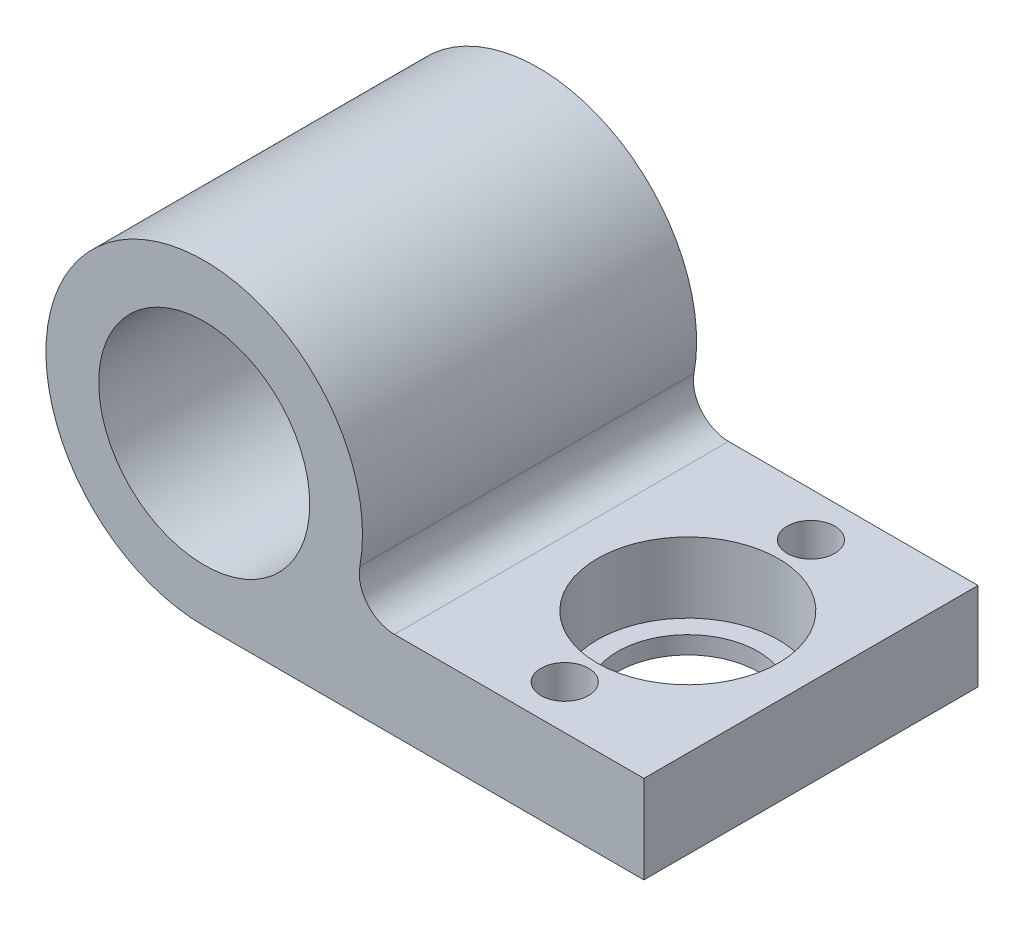
ISO-10303-21;
HEADER;
FILE_DESCRIPTION(('STEP AP214'),'2;1');
FILE_NAME('part.step','',(''),(''),'','','');
FILE_SCHEMA(('AUTOMOTIVE_DESIGN { 1 0 10303 214 1 1 1 1 }'));
ENDSEC;
DATA;
#1=APPLICATION_CONTEXT('core data for automotive mechanical design processes');
#2=APPLICATION_PROTOCOL_DEFINITION('international standard','automotive_design',2000,#1);
#3=PRODUCT_CONTEXT('',#1,'mechanical');
#4=PRODUCT('Part','Part','',(#3));
#5=PRODUCT_RELATED_PRODUCT_CATEGORY('part','',(#4));
#6=PRODUCT_DEFINITION_FORMATION('','',#4);
#7=PRODUCT_DEFINITION_CONTEXT('part definition',#1,'design');
#8=PRODUCT_DEFINITION('design','',#6,#7);
#9=PRODUCT_DEFINITION_SHAPE('','',#8);
#10=(LENGTH_UNIT() NAMED_UNIT(*) SI_UNIT(.MILLI.,.METRE.));
#11=(NAMED_UNIT(*) PLANE_ANGLE_UNIT() SI_UNIT($,.RADIAN.));
#12=(NAMED_UNIT(*) SI_UNIT($,.STERADIAN.) SOLID_ANGLE_UNIT());
#13=UNCERTAINTY_MEASURE_WITH_UNIT(LENGTH_MEASURE(1.E-05),#10,'distance_accuracy_value','');
#14=(GEOMETRIC_REPRESENTATION_CONTEXT(3) GLOBAL_UNCERTAINTY_ASSIGNED_CONTEXT((#13)) GLOBAL_UNIT_ASSIGNED_CONTEXT((#10,
#11,#12)) REPRESENTATION_CONTEXT('',''));
#15=CARTESIAN_POINT('',(0.,0.,0.));
#16=DIRECTION('',(0.,0.,1.));
#17=DIRECTION('',(1.,0.,0.));
#18=AXIS2_PLACEMENT_3D('',#15,#16,#17);
#19=CARTESIAN_POINT('',(18.,-4.,0.));
#20=DIRECTION('',(0.,-1.,0.));
#21=DIRECTION('',(0.,0.,-1.));
#22=AXIS2_PLACEMENT_3D('',#19,#20,#21);
#23=CYLINDRICAL_SURFACE('',#22,4.);
#24=CARTESIAN_POINT('',(18.,-9.,0.));
#25=DIRECTION('',(0.,1.,0.));
#26=DIRECTION('',(0.,0.,1.));
#27=AXIS2_PLACEMENT_3D('',#24,#25,#26);
#28=CIRCLE('',#27,4.);
#29=CARTESIAN_POINT('',(18.,-9.,4.));
#30=VERTEX_POINT('',#29);
#31=EDGE_CURVE('E150',#30,#30,#28,.T.);
#32=ORIENTED_EDGE('',*,*,#31,.F.);
#33=EDGE_LOOP('',(#32));
#34=FACE_BOUND('',#33,.T.);
#35=CARTESIAN_POINT('',(18.,-8.,0.));
#36=DIRECTION('',(0.,1.,0.));
#37=DIRECTION('',(0.,0.,1.));
#38=AXIS2_PLACEMENT_3D('',#35,#36,#37);
#39=CIRCLE('',#38,4.);
#40=CARTESIAN_POINT('',(18.,-8.,4.));
#41=VERTEX_POINT('',#40);
#42=EDGE_CURVE('E123',#41,#41,#39,.T.);
#43=ORIENTED_EDGE('',*,*,#42,.T.);
#44=EDGE_LOOP('',(#43));
#45=FACE_BOUND('',#44,.T.);
#46=ADVANCED_FACE('F33',(#34,#45),#23,.F.);
#47=CARTESIAN_POINT('',(0.,0.,9.5));
#48=DIRECTION('',(0.,0.,1.));
#49=DIRECTION('',(1.,0.,0.));
#50=AXIS2_PLACEMENT_3D('',#47,#48,#49);
#51=PLANE('',#50);
#52=CARTESIAN_POINT('',(0.,0.,9.5));
#53=DIRECTION('',(0.,0.,1.));
#54=DIRECTION('',(1.,0.,0.));
#55=AXIS2_PLACEMENT_3D('',#52,#53,#54);
#56=CIRCLE('',#55,6.);
#57=CARTESIAN_POINT('',(6.,0.,9.5));
#58=VERTEX_POINT('',#57);
#59=EDGE_CURVE('E113',#58,#58,#56,.T.);
#60=ORIENTED_EDGE('',*,*,#59,.F.);
#61=EDGE_LOOP('',(#60));
#62=FACE_BOUND('',#61,.T.);
#63=DIRECTION('',(1.,0.,0.));
#64=VECTOR('',#63,1.);
#65=CARTESIAN_POINT('',(0.,-4.,9.5));
#66=LINE('',#65,#64);
#67=CARTESIAN_POINT('',(10.816653826392,-4.,9.5));
#68=VERTEX_POINT('',#67);
#69=CARTESIAN_POINT('',(25.,-4.,9.5));
#70=VERTEX_POINT('',#69);
#71=EDGE_CURVE('E76',#68,#70,#66,.T.);
#72=ORIENTED_EDGE('',*,*,#71,.F.);
#73=CARTESIAN_POINT('',(10.816653826392,-2.,9.5));
#74=DIRECTION('',(0.,0.,1.));
#75=DIRECTION('',(1.,0.,0.));
#76=AXIS2_PLACEMENT_3D('',#73,#74,#75);
#77=CIRCLE('',#76,2.);
#78=CARTESIAN_POINT('',(8.8499894943207,-1.63636363636364,9.5));
#79=VERTEX_POINT('',#78);
#80=EDGE_CURVE('E11',#68,#79,#77,.F.);
#81=ORIENTED_EDGE('',*,*,#80,.T.);
#82=CARTESIAN_POINT('',(0.,0.,9.5));
#83=DIRECTION('',(0.,0.,1.));
#84=DIRECTION('',(1.,0.,0.));
#85=AXIS2_PLACEMENT_3D('',#82,#83,#84);
#86=CIRCLE('',#85,9.);
#87=CARTESIAN_POINT('',(0.,-9.,9.5));
#88=VERTEX_POINT('',#87);
#89=EDGE_CURVE('E119',#79,#88,#86,.T.);
#90=ORIENTED_EDGE('',*,*,#89,.T.);
#91=DIRECTION('',(1.,0.,0.));
#92=VECTOR('',#91,1.);
#93=CARTESIAN_POINT('',(0.,-9.,9.5));
#94=LINE('',#93,#92);
#95=CARTESIAN_POINT('',(25.,-9.,9.5));
#96=VERTEX_POINT('',#95);
#97=EDGE_CURVE('E90',#88,#96,#94,.T.);
#98=ORIENTED_EDGE('',*,*,#97,.T.);
#99=DIRECTION('',(0.,-1.,0.));
#100=VECTOR('',#99,1.);
#101=CARTESIAN_POINT('',(25.,-4.,9.5));
#102=LINE('',#101,#100);
#103=EDGE_CURVE('E87',#70,#96,#102,.T.);
#104=ORIENTED_EDGE('',*,*,#103,.F.);
#105=EDGE_LOOP('',(#72,#81,#90,#98,#104));
#106=FACE_BOUND('',#105,.T.);
#107=ADVANCED_FACE('F88',(#62,#106),#51,.T.);
#108=CARTESIAN_POINT('',(0.,0.,-9.5));
#109=DIRECTION('',(0.,0.,1.));
#110=DIRECTION('',(1.,0.,0.));
#111=AXIS2_PLACEMENT_3D('',#108,#109,#110);
#112=PLANE('',#111);
#113=CARTESIAN_POINT('',(0.,0.,-9.5));
#114=DIRECTION('',(0.,0.,1.));
#115=DIRECTION('',(1.,0.,0.));
#116=AXIS2_PLACEMENT_3D('',#113,#114,#115);
#117=CIRCLE('',#116,6.);
#118=CARTESIAN_POINT('',(6.,0.,-9.5));
#119=VERTEX_POINT('',#118);
#120=EDGE_CURVE('E93',#119,#119,#117,.T.);
#121=ORIENTED_EDGE('',*,*,#120,.T.);
#122=EDGE_LOOP('',(#121));
#123=FACE_BOUND('',#122,.T.);
#124=CARTESIAN_POINT('',(0.,0.,-9.5));
#125=DIRECTION('',(0.,0.,1.));
#126=DIRECTION('',(1.,0.,0.));
#127=AXIS2_PLACEMENT_3D('',#124,#125,#126);
#128=CIRCLE('',#127,9.);
#129=CARTESIAN_POINT('',(8.8499894943207,-1.63636363636364,-9.5));
#130=VERTEX_POINT('',#129);
#131=CARTESIAN_POINT('',(0.,-9.,-9.5));
#132=VERTEX_POINT('',#131);
#133=EDGE_CURVE('E116',#130,#132,#128,.T.);
#134=ORIENTED_EDGE('',*,*,#133,.F.);
#135=CARTESIAN_POINT('',(10.816653826392,-2.,-9.5));
#136=DIRECTION('',(0.,0.,1.));
#137=DIRECTION('',(1.,0.,0.));
#138=AXIS2_PLACEMENT_3D('',#135,#136,#137);
#139=CIRCLE('',#138,2.);
#140=CARTESIAN_POINT('',(10.816653826392,-4.,-9.5));
#141=VERTEX_POINT('',#140);
#142=EDGE_CURVE('E41',#130,#141,#139,.T.);
#143=ORIENTED_EDGE('',*,*,#142,.T.);
#144=DIRECTION('',(-1.,0.,0.));
#145=VECTOR('',#144,1.);
#146=CARTESIAN_POINT('',(0.,-4.,-9.5));
#147=LINE('',#146,#145);
#148=CARTESIAN_POINT('',(25.,-4.,-9.5));
#149=VERTEX_POINT('',#148);
#150=EDGE_CURVE('E98',#149,#141,#147,.T.);
#151=ORIENTED_EDGE('',*,*,#150,.F.);
#152=DIRECTION('',(0.,-1.,0.));
#153=VECTOR('',#152,1.);
#154=CARTESIAN_POINT('',(25.,-4.,-9.5));
#155=LINE('',#154,#153);
#156=CARTESIAN_POINT('',(25.,-9.,-9.5));
#157=VERTEX_POINT('',#156);
#158=EDGE_CURVE('E94',#149,#157,#155,.T.);
#159=ORIENTED_EDGE('',*,*,#158,.T.);
#160=DIRECTION('',(-1.,0.,0.));
#161=VECTOR('',#160,1.);
#162=CARTESIAN_POINT('',(0.,-9.,-9.5));
#163=LINE('',#162,#161);
#164=EDGE_CURVE('E84',#157,#132,#163,.T.);
#165=ORIENTED_EDGE('',*,*,#164,.T.);
#166=EDGE_LOOP('',(#134,#143,#151,#159,#165));
#167=FACE_BOUND('',#166,.T.);
#168=ADVANCED_FACE('F135',(#123,#167),#112,.F.);
#169=CARTESIAN_POINT('',(0.,0.,9.5));
#170=DIRECTION('',(0.,0.,-1.));
#171=DIRECTION('',(-1.,0.,0.));
#172=AXIS2_PLACEMENT_3D('',#169,#170,#171);
#173=CYLINDRICAL_SURFACE('',#172,9.);
#174=ORIENTED_EDGE('',*,*,#89,.F.);
#175=DIRECTION('',(0.,0.,-1.));
#176=VECTOR('',#175,1.);
#177=CARTESIAN_POINT('',(8.8499894943207,-1.63636363636364,9.5));
#178=LINE('',#177,#176);
#179=EDGE_CURVE('E121',#79,#130,#178,.T.);
#180=ORIENTED_EDGE('',*,*,#179,.T.);
#181=ORIENTED_EDGE('',*,*,#133,.T.);
#182=DIRECTION('',(0.,0.,1.));
#183=VECTOR('',#182,1.);
#184=CARTESIAN_POINT('',(0.,-9.,-9.5));
#185=LINE('',#184,#183);
#186=EDGE_CURVE('E103',#132,#88,#185,.T.);
#187=ORIENTED_EDGE('',*,*,#186,.T.);
#188=EDGE_LOOP('',(#174,#180,#181,#187));
#189=FACE_BOUND('',#188,.T.);
#190=ADVANCED_FACE('F133',(#189),#173,.T.);
#191=CARTESIAN_POINT('',(0.,0.,9.5));
#192=DIRECTION('',(0.,0.,-1.));
#193=DIRECTION('',(-1.,0.,0.));
#194=AXIS2_PLACEMENT_3D('',#191,#192,#193);
#195=CYLINDRICAL_SURFACE('',#194,6.);
#196=ORIENTED_EDGE('',*,*,#120,.F.);
#197=EDGE_LOOP('',(#196));
#198=FACE_BOUND('',#197,.T.);
#199=ORIENTED_EDGE('',*,*,#59,.T.);
#200=EDGE_LOOP('',(#199));
#201=FACE_BOUND('',#200,.T.);
#202=ADVANCED_FACE('F169',(#198,#201),#195,.F.);
#203=CARTESIAN_POINT('',(0.,-4.,0.));
#204=DIRECTION('',(0.,1.,0.));
#205=DIRECTION('',(0.,0.,1.));
#206=AXIS2_PLACEMENT_3D('',#203,#204,#205);
#207=PLANE('',#206);
#208=CARTESIAN_POINT('',(18.,-4.,0.));
#209=DIRECTION('',(0.,1.,0.));
#210=DIRECTION('',(0.,0.,1.));
#211=AXIS2_PLACEMENT_3D('',#208,#209,#210);
#212=CIRCLE('',#211,5.15);
#213=CARTESIAN_POINT('',(18.,-4.,5.15));
#214=VERTEX_POINT('',#213);
#215=EDGE_CURVE('E295',#214,#214,#212,.T.);
#216=ORIENTED_EDGE('',*,*,#215,.F.);
#217=EDGE_LOOP('',(#216));
#218=FACE_BOUND('',#217,.T.);
#219=CARTESIAN_POINT('',(18.,-4.,7.));
#220=DIRECTION('',(0.,1.,0.));
#221=DIRECTION('',(0.,0.,1.));
#222=AXIS2_PLACEMENT_3D('',#219,#220,#221);
#223=CIRCLE('',#222,1.35);
#224=CARTESIAN_POINT('',(18.,-4.,8.35));
#225=VERTEX_POINT('',#224);
#226=EDGE_CURVE('E106',#225,#225,#223,.T.);
#227=ORIENTED_EDGE('',*,*,#226,.F.);
#228=EDGE_LOOP('',(#227));
#229=FACE_BOUND('',#228,.T.);
#230=CARTESIAN_POINT('',(18.,-4.,-7.));
#231=DIRECTION('',(0.,1.,0.));
#232=DIRECTION('',(0.,0.,1.));
#233=AXIS2_PLACEMENT_3D('',#230,#231,#232);
#234=CIRCLE('',#233,1.35);
#235=CARTESIAN_POINT('',(18.,-4.,-5.65));
#236=VERTEX_POINT('',#235);
#237=EDGE_CURVE('E154',#236,#236,#234,.T.);
#238=ORIENTED_EDGE('',*,*,#237,.F.);
#239=EDGE_LOOP('',(#238));
#240=FACE_BOUND('',#239,.T.);
#241=ORIENTED_EDGE('',*,*,#150,.T.);
#242=DIRECTION('',(0.,0.,-1.));
#243=VECTOR('',#242,1.);
#244=CARTESIAN_POINT('',(10.816653826392,-4.,0.));
#245=LINE('',#244,#243);
#246=EDGE_CURVE('E54',#141,#68,#245,.F.);
#247=ORIENTED_EDGE('',*,*,#246,.T.);
#248=ORIENTED_EDGE('',*,*,#71,.T.);
#249=DIRECTION('',(0.,0.,-1.));
#250=VECTOR('',#249,1.);
#251=CARTESIAN_POINT('',(25.,-4.,-9.5));
#252=LINE('',#251,#250);
#253=EDGE_CURVE('E80',#70,#149,#252,.T.);
#254=ORIENTED_EDGE('',*,*,#253,.T.);
#255=EDGE_LOOP('',(#241,#247,#248,#254));
#256=FACE_BOUND('',#255,.T.);
#257=ADVANCED_FACE('F78',(#218,#229,#240,#256),#207,.T.);
#258=CARTESIAN_POINT('',(0.,-9.,0.));
#259=DIRECTION('',(0.,1.,0.));
#260=DIRECTION('',(0.,0.,1.));
#261=AXIS2_PLACEMENT_3D('',#258,#259,#260);
#262=PLANE('',#261);
#263=ORIENTED_EDGE('',*,*,#186,.F.);
#264=ORIENTED_EDGE('',*,*,#164,.F.);
#265=DIRECTION('',(0.,0.,-1.));
#266=VECTOR('',#265,1.);
#267=CARTESIAN_POINT('',(25.,-9.,-9.5));
#268=LINE('',#267,#266);
#269=EDGE_CURVE('E108',#96,#157,#268,.T.);
#270=ORIENTED_EDGE('',*,*,#269,.F.);
#271=ORIENTED_EDGE('',*,*,#97,.F.);
#272=EDGE_LOOP('',(#263,#264,#270,#271));
#273=FACE_BOUND('',#272,.T.);
#274=CARTESIAN_POINT('',(18.,-9.,7.));
#275=DIRECTION('',(0.,1.,0.));
#276=DIRECTION('',(0.,0.,1.));
#277=AXIS2_PLACEMENT_3D('',#274,#275,#276);
#278=CIRCLE('',#277,1.35);
#279=CARTESIAN_POINT('',(18.,-9.,8.35));
#280=VERTEX_POINT('',#279);
#281=EDGE_CURVE('E146',#280,#280,#278,.T.);
#282=ORIENTED_EDGE('',*,*,#281,.T.);
#283=EDGE_LOOP('',(#282));
#284=FACE_BOUND('',#283,.T.);
#285=ORIENTED_EDGE('',*,*,#31,.T.);
#286=EDGE_LOOP('',(#285));
#287=FACE_BOUND('',#286,.T.);
#288=CARTESIAN_POINT('',(18.,-9.,-7.));
#289=DIRECTION('',(0.,1.,0.));
#290=DIRECTION('',(0.,0.,1.));
#291=AXIS2_PLACEMENT_3D('',#288,#289,#290);
#292=CIRCLE('',#291,1.35);
#293=CARTESIAN_POINT('',(18.,-9.,-5.65));
#294=VERTEX_POINT('',#293);
#295=EDGE_CURVE('E126',#294,#294,#292,.T.);
#296=ORIENTED_EDGE('',*,*,#295,.T.);
#297=EDGE_LOOP('',(#296));
#298=FACE_BOUND('',#297,.T.);
#299=ADVANCED_FACE('F139',(#273,#284,#287,#298),#262,.F.);
#300=CARTESIAN_POINT('',(25.,-4.,-9.5));
#301=DIRECTION('',(-1.,0.,0.));
#302=DIRECTION('',(0.,0.,1.));
#303=AXIS2_PLACEMENT_3D('',#300,#301,#302);
#304=PLANE('',#303);
#305=ORIENTED_EDGE('',*,*,#269,.T.);
#306=ORIENTED_EDGE('',*,*,#158,.F.);
#307=ORIENTED_EDGE('',*,*,#253,.F.);
#308=ORIENTED_EDGE('',*,*,#103,.T.);
#309=EDGE_LOOP('',(#305,#306,#307,#308));
#310=FACE_BOUND('',#309,.T.);
#311=ADVANCED_FACE('F96',(#310),#304,.F.);
#312=CARTESIAN_POINT('',(18.,-4.,7.));
#313=DIRECTION('',(0.,-1.,0.));
#314=DIRECTION('',(0.,0.,-1.));
#315=AXIS2_PLACEMENT_3D('',#312,#313,#314);
#316=CYLINDRICAL_SURFACE('',#315,1.35);
#317=ORIENTED_EDGE('',*,*,#226,.T.);
#318=EDGE_LOOP('',(#317));
#319=FACE_BOUND('',#318,.T.);
#320=ORIENTED_EDGE('',*,*,#281,.F.);
#321=EDGE_LOOP('',(#320));
#322=FACE_BOUND('',#321,.T.);
#323=ADVANCED_FACE('F164',(#319,#322),#316,.F.);
#324=CARTESIAN_POINT('',(18.,-4.,-7.));
#325=DIRECTION('',(0.,-1.,0.));
#326=DIRECTION('',(0.,0.,-1.));
#327=AXIS2_PLACEMENT_3D('',#324,#325,#326);
#328=CYLINDRICAL_SURFACE('',#327,1.35);
#329=ORIENTED_EDGE('',*,*,#237,.T.);
#330=EDGE_LOOP('',(#329));
#331=FACE_BOUND('',#330,.T.);
#332=ORIENTED_EDGE('',*,*,#295,.F.);
#333=EDGE_LOOP('',(#332));
#334=FACE_BOUND('',#333,.T.);
#335=ADVANCED_FACE('F174',(#331,#334),#328,.F.);
#336=CARTESIAN_POINT('',(18.,-8.,0.));
#337=DIRECTION('',(0.,1.,0.));
#338=DIRECTION('',(0.,0.,1.));
#339=AXIS2_PLACEMENT_3D('',#336,#337,#338);
#340=CYLINDRICAL_SURFACE('',#339,5.15);
#341=CARTESIAN_POINT('',(18.,-8.,0.));
#342=DIRECTION('',(0.,1.,0.));
#343=DIRECTION('',(0.,0.,1.));
#344=AXIS2_PLACEMENT_3D('',#341,#342,#343);
#345=CIRCLE('',#344,5.15);
#346=CARTESIAN_POINT('',(18.,-8.,5.15));
#347=VERTEX_POINT('',#346);
#348=EDGE_CURVE('E127',#347,#347,#345,.T.);
#349=ORIENTED_EDGE('',*,*,#348,.F.);
#350=EDGE_LOOP('',(#349));
#351=FACE_BOUND('',#350,.T.);
#352=ORIENTED_EDGE('',*,*,#215,.T.);
#353=EDGE_LOOP('',(#352));
#354=FACE_BOUND('',#353,.T.);
#355=ADVANCED_FACE('F176',(#351,#354),#340,.F.);
#356=CARTESIAN_POINT('',(18.,-8.,0.));
#357=DIRECTION('',(0.,1.,0.));
#358=DIRECTION('',(0.,0.,1.));
#359=AXIS2_PLACEMENT_3D('',#356,#357,#358);
#360=PLANE('',#359);
#361=ORIENTED_EDGE('',*,*,#42,.F.);
#362=EDGE_LOOP('',(#361));
#363=FACE_BOUND('',#362,.T.);
#364=ORIENTED_EDGE('',*,*,#348,.T.);
#365=EDGE_LOOP('',(#364));
#366=FACE_BOUND('',#365,.T.);
#367=ADVANCED_FACE('F182',(#363,#366),#360,.T.);
#368=CARTESIAN_POINT('',(10.816653826392,-2.,9.5));
#369=DIRECTION('',(0.,0.,-1.));
#370=DIRECTION('',(-1.,0.,0.));
#371=AXIS2_PLACEMENT_3D('',#368,#369,#370);
#372=CYLINDRICAL_SURFACE('',#371,2.);
#373=ORIENTED_EDGE('',*,*,#80,.F.);
#374=ORIENTED_EDGE('',*,*,#246,.F.);
#375=ORIENTED_EDGE('',*,*,#142,.F.);
#376=ORIENTED_EDGE('',*,*,#179,.F.);
#377=EDGE_LOOP('',(#373,#374,#375,#376));
#378=FACE_BOUND('',#377,.T.);
#379=ADVANCED_FACE('F35',(#378),#372,.F.);
#380=CLOSED_SHELL('',(#46,#107,#168,#190,#202,#257,#299,#311,#323,#335,#355,#367,#379));
#381=MANIFOLD_SOLID_BREP('B2',#380);
#382=ADVANCED_BREP_SHAPE_REPRESENTATION('',(#18,#381),#14);
#383=SHAPE_DEFINITION_REPRESENTATION(#9,#382);
ENDSEC;
END-ISO-10303-21;
